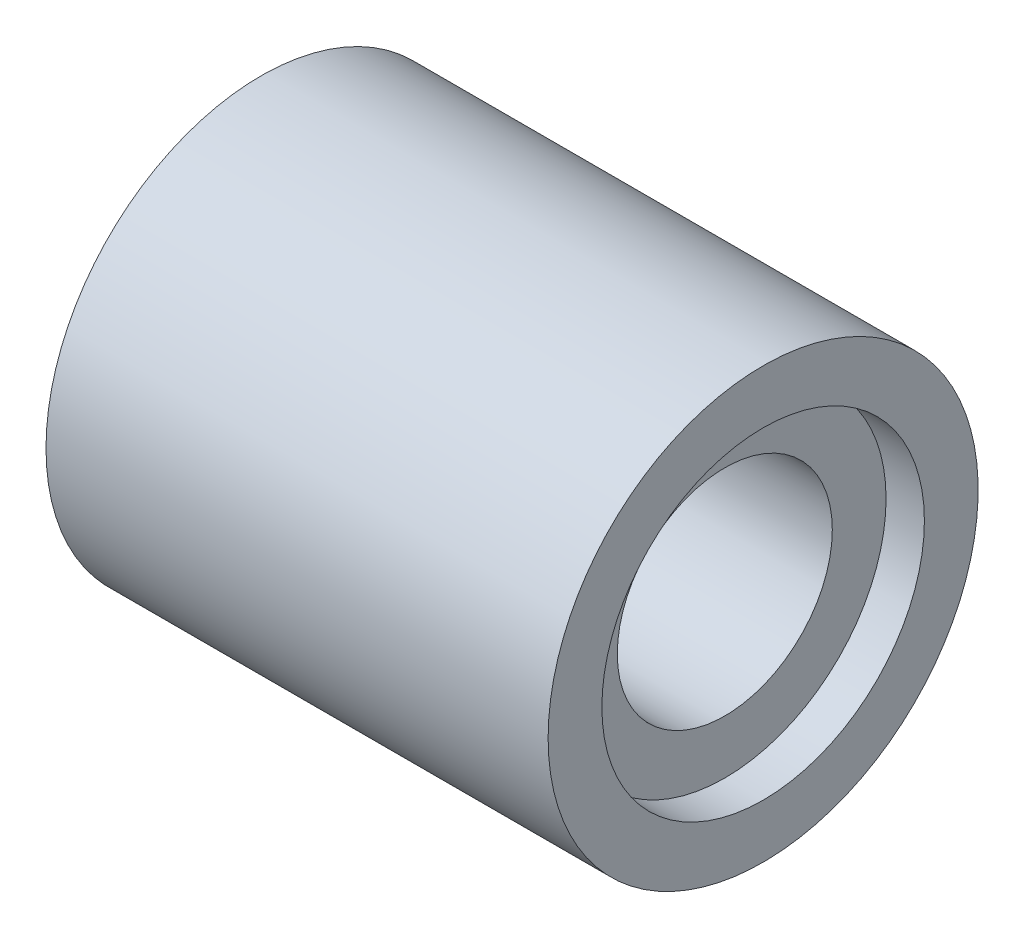
ISO-10303-21;
HEADER;
FILE_DESCRIPTION(('STEP AP214'),'2;1');
FILE_NAME('part.step','',(''),(''),'','','');
FILE_SCHEMA(('AUTOMOTIVE_DESIGN { 1 0 10303 214 1 1 1 1 }'));
ENDSEC;
DATA;
#1=APPLICATION_CONTEXT('core data for automotive mechanical design processes');
#2=APPLICATION_PROTOCOL_DEFINITION('international standard','automotive_design',2000,#1);
#3=PRODUCT_CONTEXT('',#1,'mechanical');
#4=PRODUCT('Part','Part','',(#3));
#5=PRODUCT_RELATED_PRODUCT_CATEGORY('part','',(#4));
#6=PRODUCT_DEFINITION_FORMATION('','',#4);
#7=PRODUCT_DEFINITION_CONTEXT('part definition',#1,'design');
#8=PRODUCT_DEFINITION('design','',#6,#7);
#9=PRODUCT_DEFINITION_SHAPE('','',#8);
#10=(LENGTH_UNIT() NAMED_UNIT(*) SI_UNIT(.MILLI.,.METRE.));
#11=(NAMED_UNIT(*) PLANE_ANGLE_UNIT() SI_UNIT($,.RADIAN.));
#12=(NAMED_UNIT(*) SI_UNIT($,.STERADIAN.) SOLID_ANGLE_UNIT());
#13=UNCERTAINTY_MEASURE_WITH_UNIT(LENGTH_MEASURE(1.E-05),#10,'distance_accuracy_value','');
#14=(GEOMETRIC_REPRESENTATION_CONTEXT(3) GLOBAL_UNCERTAINTY_ASSIGNED_CONTEXT((#13)) GLOBAL_UNIT_ASSIGNED_CONTEXT((#10,
#11,#12)) REPRESENTATION_CONTEXT('',''));
#15=CARTESIAN_POINT('',(0.,0.,0.));
#16=DIRECTION('',(0.,0.,1.));
#17=DIRECTION('',(1.,0.,0.));
#18=AXIS2_PLACEMENT_3D('',#15,#16,#17);
#19=CARTESIAN_POINT('',(-29.3839701249643,0.,0.));
#20=DIRECTION('',(-1.,0.,0.));
#21=DIRECTION('',(0.,0.,1.));
#22=AXIS2_PLACEMENT_3D('',#19,#20,#21);
#23=CYLINDRICAL_SURFACE('',#22,20.);
#24=CARTESIAN_POINT('',(-25.3535122716716,0.,0.));
#25=DIRECTION('',(-1.,0.,0.));
#26=DIRECTION('',(0.,0.,1.));
#27=AXIS2_PLACEMENT_3D('',#24,#25,#26);
#28=CIRCLE('',#27,20.);
#29=CARTESIAN_POINT('',(-25.3535122716716,0.,20.));
#30=VERTEX_POINT('',#29);
#31=EDGE_CURVE('E10',#30,#30,#28,.T.);
#32=ORIENTED_EDGE('',*,*,#31,.F.);
#33=EDGE_LOOP('',(#32));
#34=FACE_BOUND('',#33,.T.);
#35=CARTESIAN_POINT('',(21.3514081904193,0.,0.));
#36=DIRECTION('',(-1.,0.,0.));
#37=DIRECTION('',(0.,0.,1.));
#38=AXIS2_PLACEMENT_3D('',#35,#36,#37);
#39=CIRCLE('',#38,20.);
#40=CARTESIAN_POINT('',(21.3514081904193,0.,20.));
#41=VERTEX_POINT('',#40);
#42=EDGE_CURVE('E72',#41,#41,#39,.T.);
#43=ORIENTED_EDGE('',*,*,#42,.T.);
#44=EDGE_LOOP('',(#43));
#45=FACE_BOUND('',#44,.T.);
#46=ADVANCED_FACE('F37',(#34,#45),#23,.T.);
#47=CARTESIAN_POINT('',(-25.3535122716716,20.,0.));
#48=DIRECTION('',(1.,0.,0.));
#49=DIRECTION('',(0.,0.,-1.));
#50=AXIS2_PLACEMENT_3D('',#47,#48,#49);
#51=PLANE('',#50);
#52=CARTESIAN_POINT('',(-25.3535122716716,0.,0.));
#53=DIRECTION('',(-1.,0.,0.));
#54=DIRECTION('',(0.,0.,1.));
#55=AXIS2_PLACEMENT_3D('',#52,#53,#54);
#56=CIRCLE('',#55,15.);
#57=CARTESIAN_POINT('',(-25.3535122716716,0.,15.));
#58=VERTEX_POINT('',#57);
#59=EDGE_CURVE('E44',#58,#58,#56,.T.);
#60=ORIENTED_EDGE('',*,*,#59,.F.);
#61=EDGE_LOOP('',(#60));
#62=FACE_BOUND('',#61,.T.);
#63=ORIENTED_EDGE('',*,*,#31,.T.);
#64=EDGE_LOOP('',(#63));
#65=FACE_BOUND('',#64,.T.);
#66=ADVANCED_FACE('F110',(#62,#65),#51,.F.);
#67=CARTESIAN_POINT('',(-29.3839701249643,0.,0.));
#68=DIRECTION('',(-1.,0.,0.));
#69=DIRECTION('',(0.,0.,1.));
#70=AXIS2_PLACEMENT_3D('',#67,#68,#69);
#71=CYLINDRICAL_SURFACE('',#70,15.);
#72=CARTESIAN_POINT('',(-21.3682121723614,0.,0.));
#73=DIRECTION('',(-1.,0.,0.));
#74=DIRECTION('',(0.,0.,1.));
#75=AXIS2_PLACEMENT_3D('',#72,#73,#74);
#76=CIRCLE('',#75,15.);
#77=CARTESIAN_POINT('',(-21.3682121723614,0.,15.));
#78=VERTEX_POINT('',#77);
#79=EDGE_CURVE('E49',#78,#78,#76,.T.);
#80=ORIENTED_EDGE('',*,*,#79,.F.);
#81=EDGE_LOOP('',(#80));
#82=FACE_BOUND('',#81,.T.);
#83=ORIENTED_EDGE('',*,*,#59,.T.);
#84=EDGE_LOOP('',(#83));
#85=FACE_BOUND('',#84,.T.);
#86=ADVANCED_FACE('F105',(#82,#85),#71,.F.);
#87=CARTESIAN_POINT('',(-21.3682121723614,15.,0.));
#88=DIRECTION('',(1.,0.,0.));
#89=DIRECTION('',(0.,0.,-1.));
#90=AXIS2_PLACEMENT_3D('',#87,#88,#89);
#91=PLANE('',#90);
#92=CARTESIAN_POINT('',(-21.3682121723614,0.,0.));
#93=DIRECTION('',(-1.,0.,0.));
#94=DIRECTION('',(0.,0.,1.));
#95=AXIS2_PLACEMENT_3D('',#92,#93,#94);
#96=CIRCLE('',#95,10.);
#97=CARTESIAN_POINT('',(-21.3682121723614,0.,10.));
#98=VERTEX_POINT('',#97);
#99=EDGE_CURVE('E54',#98,#98,#96,.T.);
#100=ORIENTED_EDGE('',*,*,#99,.F.);
#101=EDGE_LOOP('',(#100));
#102=FACE_BOUND('',#101,.T.);
#103=ORIENTED_EDGE('',*,*,#79,.T.);
#104=EDGE_LOOP('',(#103));
#105=FACE_BOUND('',#104,.T.);
#106=ADVANCED_FACE('F99',(#102,#105),#91,.F.);
#107=CARTESIAN_POINT('',(-29.3839701249643,0.,0.));
#108=DIRECTION('',(-1.,0.,0.));
#109=DIRECTION('',(0.,0.,1.));
#110=AXIS2_PLACEMENT_3D('',#107,#108,#109);
#111=CYLINDRICAL_SURFACE('',#110,10.);
#112=CARTESIAN_POINT('',(17.7856133647207,0.,0.));
#113=DIRECTION('',(-1.,0.,0.));
#114=DIRECTION('',(0.,0.,1.));
#115=AXIS2_PLACEMENT_3D('',#112,#113,#114);
#116=CIRCLE('',#115,10.);
#117=CARTESIAN_POINT('',(17.7856133647207,0.,10.));
#118=VERTEX_POINT('',#117);
#119=EDGE_CURVE('E60',#118,#118,#116,.T.);
#120=ORIENTED_EDGE('',*,*,#119,.F.);
#121=EDGE_LOOP('',(#120));
#122=FACE_BOUND('',#121,.T.);
#123=ORIENTED_EDGE('',*,*,#99,.T.);
#124=EDGE_LOOP('',(#123));
#125=FACE_BOUND('',#124,.T.);
#126=ADVANCED_FACE('F93',(#122,#125),#111,.F.);
#127=CARTESIAN_POINT('',(17.7856133647207,10.,0.));
#128=DIRECTION('',(-1.,0.,0.));
#129=DIRECTION('',(0.,0.,1.));
#130=AXIS2_PLACEMENT_3D('',#127,#128,#129);
#131=PLANE('',#130);
#132=CARTESIAN_POINT('',(17.7856133647207,0.,0.));
#133=DIRECTION('',(-1.,0.,0.));
#134=DIRECTION('',(0.,0.,1.));
#135=AXIS2_PLACEMENT_3D('',#132,#133,#134);
#136=CIRCLE('',#135,15.);
#137=CARTESIAN_POINT('',(17.7856133647207,0.,15.));
#138=VERTEX_POINT('',#137);
#139=EDGE_CURVE('E64',#138,#138,#136,.T.);
#140=ORIENTED_EDGE('',*,*,#139,.F.);
#141=EDGE_LOOP('',(#140));
#142=FACE_BOUND('',#141,.T.);
#143=ORIENTED_EDGE('',*,*,#119,.T.);
#144=EDGE_LOOP('',(#143));
#145=FACE_BOUND('',#144,.T.);
#146=ADVANCED_FACE('F87',(#142,#145),#131,.F.);
#147=CARTESIAN_POINT('',(-29.3839701249643,0.,0.));
#148=DIRECTION('',(-1.,0.,0.));
#149=DIRECTION('',(0.,0.,1.));
#150=AXIS2_PLACEMENT_3D('',#147,#148,#149);
#151=CYLINDRICAL_SURFACE('',#150,15.);
#152=CARTESIAN_POINT('',(21.3514081904193,0.,0.));
#153=DIRECTION('',(-1.,0.,0.));
#154=DIRECTION('',(0.,0.,1.));
#155=AXIS2_PLACEMENT_3D('',#152,#153,#154);
#156=CIRCLE('',#155,15.);
#157=CARTESIAN_POINT('',(21.3514081904193,0.,15.));
#158=VERTEX_POINT('',#157);
#159=EDGE_CURVE('E68',#158,#158,#156,.T.);
#160=ORIENTED_EDGE('',*,*,#159,.F.);
#161=EDGE_LOOP('',(#160));
#162=FACE_BOUND('',#161,.T.);
#163=ORIENTED_EDGE('',*,*,#139,.T.);
#164=EDGE_LOOP('',(#163));
#165=FACE_BOUND('',#164,.T.);
#166=ADVANCED_FACE('F81',(#162,#165),#151,.F.);
#167=CARTESIAN_POINT('',(21.3514081904193,15.,0.));
#168=DIRECTION('',(-1.,0.,0.));
#169=DIRECTION('',(0.,0.,1.));
#170=AXIS2_PLACEMENT_3D('',#167,#168,#169);
#171=PLANE('',#170);
#172=ORIENTED_EDGE('',*,*,#42,.F.);
#173=EDGE_LOOP('',(#172));
#174=FACE_BOUND('',#173,.T.);
#175=ORIENTED_EDGE('',*,*,#159,.T.);
#176=EDGE_LOOP('',(#175));
#177=FACE_BOUND('',#176,.T.);
#178=ADVANCED_FACE('F78',(#174,#177),#171,.F.);
#179=CLOSED_SHELL('',(#46,#66,#86,#106,#126,#146,#166,#178));
#180=MANIFOLD_SOLID_BREP('B2',#179);
#181=ADVANCED_BREP_SHAPE_REPRESENTATION('',(#18,#180),#14);
#182=SHAPE_DEFINITION_REPRESENTATION(#9,#181);
ENDSEC;
END-ISO-10303-21;
